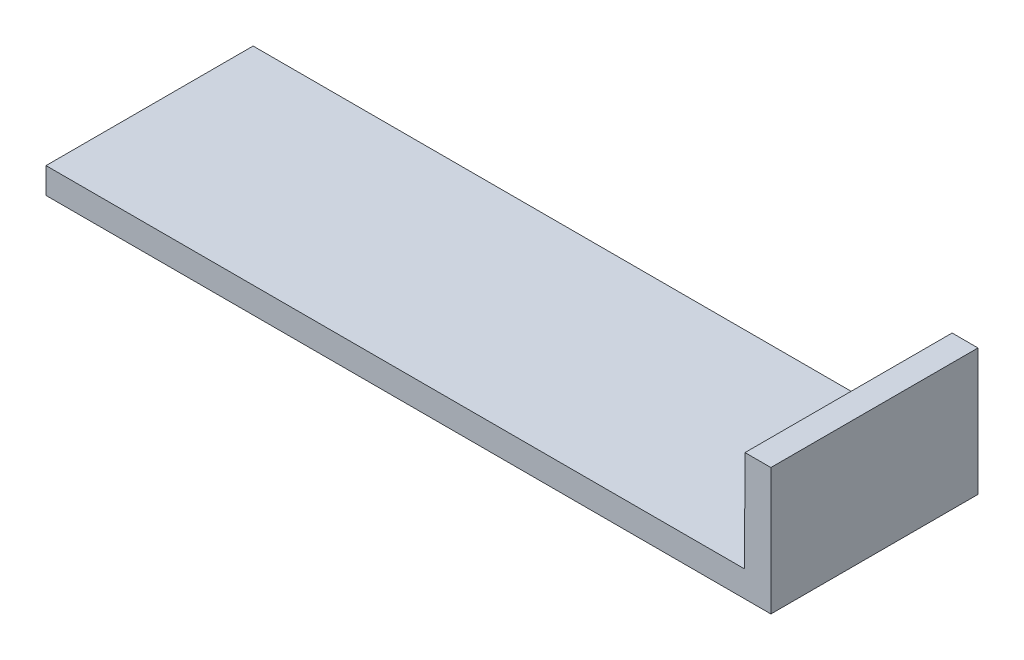
ISO-10303-21;
HEADER;
FILE_DESCRIPTION(('STEP AP214'),'2;1');
FILE_NAME('part.step','',(''),(''),'','','');
FILE_SCHEMA(('AUTOMOTIVE_DESIGN { 1 0 10303 214 1 1 1 1 }'));
ENDSEC;
DATA;
#1=APPLICATION_CONTEXT('core data for automotive mechanical design processes');
#2=APPLICATION_PROTOCOL_DEFINITION('international standard','automotive_design',2000,#1);
#3=PRODUCT_CONTEXT('',#1,'mechanical');
#4=PRODUCT('Part','Part','',(#3));
#5=PRODUCT_RELATED_PRODUCT_CATEGORY('part','',(#4));
#6=PRODUCT_DEFINITION_FORMATION('','',#4);
#7=PRODUCT_DEFINITION_CONTEXT('part definition',#1,'design');
#8=PRODUCT_DEFINITION('design','',#6,#7);
#9=PRODUCT_DEFINITION_SHAPE('','',#8);
#10=(LENGTH_UNIT() NAMED_UNIT(*) SI_UNIT(.MILLI.,.METRE.));
#11=(NAMED_UNIT(*) PLANE_ANGLE_UNIT() SI_UNIT($,.RADIAN.));
#12=(NAMED_UNIT(*) SI_UNIT($,.STERADIAN.) SOLID_ANGLE_UNIT());
#13=UNCERTAINTY_MEASURE_WITH_UNIT(LENGTH_MEASURE(1.E-05),#10,'distance_accuracy_value','');
#14=(GEOMETRIC_REPRESENTATION_CONTEXT(3) GLOBAL_UNCERTAINTY_ASSIGNED_CONTEXT((#13)) GLOBAL_UNIT_ASSIGNED_CONTEXT((#10,
#11,#12)) REPRESENTATION_CONTEXT('',''));
#15=CARTESIAN_POINT('',(0.,0.,0.));
#16=DIRECTION('',(0.,0.,1.));
#17=DIRECTION('',(1.,0.,0.));
#18=AXIS2_PLACEMENT_3D('',#15,#16,#17);
#19=CARTESIAN_POINT('',(0.,15.5575,25.4));
#20=DIRECTION('',(-1.,0.,0.));
#21=DIRECTION('',(0.,-1.,0.));
#22=AXIS2_PLACEMENT_3D('',#19,#20,#21);
#23=PLANE('',#22);
#24=DIRECTION('',(0.,1.,0.));
#25=VECTOR('',#24,1.);
#26=CARTESIAN_POINT('',(0.,15.5575,0.));
#27=LINE('',#26,#25);
#28=CARTESIAN_POINT('',(0.,0.,0.));
#29=VERTEX_POINT('',#28);
#30=CARTESIAN_POINT('',(0.,15.5575,0.));
#31=VERTEX_POINT('',#30);
#32=EDGE_CURVE('E117',#29,#31,#27,.T.);
#33=ORIENTED_EDGE('',*,*,#32,.T.);
#34=DIRECTION('',(0.,0.,-1.));
#35=VECTOR('',#34,1.);
#36=CARTESIAN_POINT('',(0.,15.5575,25.4));
#37=LINE('',#36,#35);
#38=CARTESIAN_POINT('',(0.,15.5575,25.4));
#39=VERTEX_POINT('',#38);
#40=EDGE_CURVE('E11',#39,#31,#37,.T.);
#41=ORIENTED_EDGE('',*,*,#40,.F.);
#42=DIRECTION('',(0.,1.,0.));
#43=VECTOR('',#42,1.);
#44=CARTESIAN_POINT('',(0.,15.5575,25.4));
#45=LINE('',#44,#43);
#46=CARTESIAN_POINT('',(0.,0.,25.4));
#47=VERTEX_POINT('',#46);
#48=EDGE_CURVE('E127',#47,#39,#45,.T.);
#49=ORIENTED_EDGE('',*,*,#48,.F.);
#50=DIRECTION('',(0.,0.,-1.));
#51=VECTOR('',#50,1.);
#52=CARTESIAN_POINT('',(0.,0.,25.4));
#53=LINE('',#52,#51);
#54=EDGE_CURVE('E113',#47,#29,#53,.T.);
#55=ORIENTED_EDGE('',*,*,#54,.T.);
#56=EDGE_LOOP('',(#33,#41,#49,#55));
#57=FACE_BOUND('',#56,.T.);
#58=ADVANCED_FACE('F33',(#57),#23,.F.);
#59=CARTESIAN_POINT('',(-3.175,15.5575,25.4));
#60=DIRECTION('',(0.,-1.,0.));
#61=DIRECTION('',(1.,0.,0.));
#62=AXIS2_PLACEMENT_3D('',#59,#60,#61);
#63=PLANE('',#62);
#64=DIRECTION('',(-1.,0.,0.));
#65=VECTOR('',#64,1.);
#66=CARTESIAN_POINT('',(-3.175,15.5575,0.));
#67=LINE('',#66,#65);
#68=CARTESIAN_POINT('',(-3.175,15.5575,0.));
#69=VERTEX_POINT('',#68);
#70=EDGE_CURVE('E120',#31,#69,#67,.T.);
#71=ORIENTED_EDGE('',*,*,#70,.T.);
#72=DIRECTION('',(0.,0.,-1.));
#73=VECTOR('',#72,1.);
#74=CARTESIAN_POINT('',(-3.175,15.5575,25.4));
#75=LINE('',#74,#73);
#76=CARTESIAN_POINT('',(-3.175,15.5575,25.4));
#77=VERTEX_POINT('',#76);
#78=EDGE_CURVE('E41',#77,#69,#75,.T.);
#79=ORIENTED_EDGE('',*,*,#78,.F.);
#80=DIRECTION('',(-1.,0.,0.));
#81=VECTOR('',#80,1.);
#82=CARTESIAN_POINT('',(-3.175,15.5575,25.4));
#83=LINE('',#82,#81);
#84=EDGE_CURVE('E86',#39,#77,#83,.T.);
#85=ORIENTED_EDGE('',*,*,#84,.F.);
#86=ORIENTED_EDGE('',*,*,#40,.T.);
#87=EDGE_LOOP('',(#71,#79,#85,#86));
#88=FACE_BOUND('',#87,.T.);
#89=ADVANCED_FACE('F151',(#88),#63,.F.);
#90=CARTESIAN_POINT('',(-3.23849999999999,3.17499999999999,25.4));
#91=DIRECTION('',(0.99998685101543,-0.00512813769751423,0.));
#92=DIRECTION('',(0.00512813769751423,0.99998685101543,0.));
#93=AXIS2_PLACEMENT_3D('',#90,#91,#92);
#94=PLANE('',#93);
#95=DIRECTION('',(-0.00512813769751423,-0.99998685101543,0.));
#96=VECTOR('',#95,1.);
#97=CARTESIAN_POINT('',(-3.23849999999999,3.17499999999999,0.));
#98=LINE('',#97,#96);
#99=CARTESIAN_POINT('',(-3.23849999999999,3.17499999999999,0.));
#100=VERTEX_POINT('',#99);
#101=EDGE_CURVE('E122',#69,#100,#98,.T.);
#102=ORIENTED_EDGE('',*,*,#101,.T.);
#103=DIRECTION('',(0.,0.,-1.));
#104=VECTOR('',#103,1.);
#105=CARTESIAN_POINT('',(-3.23849999999999,3.17499999999999,25.4));
#106=LINE('',#105,#104);
#107=CARTESIAN_POINT('',(-3.23849999999999,3.17499999999999,25.4));
#108=VERTEX_POINT('',#107);
#109=EDGE_CURVE('E108',#108,#100,#106,.T.);
#110=ORIENTED_EDGE('',*,*,#109,.F.);
#111=DIRECTION('',(-0.00512813769751423,-0.99998685101543,0.));
#112=VECTOR('',#111,1.);
#113=CARTESIAN_POINT('',(-3.23849999999999,3.17499999999999,25.4));
#114=LINE('',#113,#112);
#115=EDGE_CURVE('E99',#77,#108,#114,.T.);
#116=ORIENTED_EDGE('',*,*,#115,.F.);
#117=ORIENTED_EDGE('',*,*,#78,.T.);
#118=EDGE_LOOP('',(#102,#110,#116,#117));
#119=FACE_BOUND('',#118,.T.);
#120=ADVANCED_FACE('F133',(#119),#94,.F.);
#121=CARTESIAN_POINT('',(-88.9,3.17499999999999,25.4));
#122=DIRECTION('',(0.,-1.,0.));
#123=DIRECTION('',(0.,0.,-1.));
#124=AXIS2_PLACEMENT_3D('',#121,#122,#123);
#125=PLANE('',#124);
#126=DIRECTION('',(-1.,0.,0.));
#127=VECTOR('',#126,1.);
#128=CARTESIAN_POINT('',(-88.9,3.17499999999999,0.));
#129=LINE('',#128,#127);
#130=CARTESIAN_POINT('',(-88.9,3.17499999999999,0.));
#131=VERTEX_POINT('',#130);
#132=EDGE_CURVE('E107',#100,#131,#129,.T.);
#133=ORIENTED_EDGE('',*,*,#132,.T.);
#134=DIRECTION('',(0.,0.,-1.));
#135=VECTOR('',#134,1.);
#136=CARTESIAN_POINT('',(-88.9,3.17499999999999,25.4));
#137=LINE('',#136,#135);
#138=CARTESIAN_POINT('',(-88.9,3.17499999999999,25.4));
#139=VERTEX_POINT('',#138);
#140=EDGE_CURVE('E104',#139,#131,#137,.T.);
#141=ORIENTED_EDGE('',*,*,#140,.F.);
#142=DIRECTION('',(-1.,0.,0.));
#143=VECTOR('',#142,1.);
#144=CARTESIAN_POINT('',(-88.9,3.17499999999999,25.4));
#145=LINE('',#144,#143);
#146=EDGE_CURVE('E93',#108,#139,#145,.T.);
#147=ORIENTED_EDGE('',*,*,#146,.F.);
#148=ORIENTED_EDGE('',*,*,#109,.T.);
#149=EDGE_LOOP('',(#133,#141,#147,#148));
#150=FACE_BOUND('',#149,.T.);
#151=ADVANCED_FACE('F105',(#150),#125,.F.);
#152=CARTESIAN_POINT('',(-88.9,0.,25.4));
#153=DIRECTION('',(1.,0.,0.));
#154=DIRECTION('',(0.,0.,-1.));
#155=AXIS2_PLACEMENT_3D('',#152,#153,#154);
#156=PLANE('',#155);
#157=DIRECTION('',(0.,-1.,0.));
#158=VECTOR('',#157,1.);
#159=CARTESIAN_POINT('',(-88.9,0.,0.));
#160=LINE('',#159,#158);
#161=CARTESIAN_POINT('',(-88.9,0.,0.));
#162=VERTEX_POINT('',#161);
#163=EDGE_CURVE('E72',#131,#162,#160,.T.);
#164=ORIENTED_EDGE('',*,*,#163,.T.);
#165=DIRECTION('',(0.,0.,-1.));
#166=VECTOR('',#165,1.);
#167=CARTESIAN_POINT('',(-88.9,0.,25.4));
#168=LINE('',#167,#166);
#169=CARTESIAN_POINT('',(-88.9,0.,25.4));
#170=VERTEX_POINT('',#169);
#171=EDGE_CURVE('E109',#170,#162,#168,.T.);
#172=ORIENTED_EDGE('',*,*,#171,.F.);
#173=DIRECTION('',(0.,-1.,0.));
#174=VECTOR('',#173,1.);
#175=CARTESIAN_POINT('',(-88.9,0.,25.4));
#176=LINE('',#175,#174);
#177=EDGE_CURVE('E97',#139,#170,#176,.T.);
#178=ORIENTED_EDGE('',*,*,#177,.F.);
#179=ORIENTED_EDGE('',*,*,#140,.T.);
#180=EDGE_LOOP('',(#164,#172,#178,#179));
#181=FACE_BOUND('',#180,.T.);
#182=ADVANCED_FACE('F111',(#181),#156,.F.);
#183=CARTESIAN_POINT('',(0.,0.,25.4));
#184=DIRECTION('',(0.,1.,0.));
#185=DIRECTION('',(-1.,0.,0.));
#186=AXIS2_PLACEMENT_3D('',#183,#184,#185);
#187=PLANE('',#186);
#188=DIRECTION('',(1.,0.,0.));
#189=VECTOR('',#188,1.);
#190=CARTESIAN_POINT('',(0.,0.,0.));
#191=LINE('',#190,#189);
#192=EDGE_CURVE('E78',#162,#29,#191,.T.);
#193=ORIENTED_EDGE('',*,*,#192,.T.);
#194=ORIENTED_EDGE('',*,*,#54,.F.);
#195=DIRECTION('',(1.,0.,0.));
#196=VECTOR('',#195,1.);
#197=CARTESIAN_POINT('',(0.,0.,25.4));
#198=LINE('',#197,#196);
#199=EDGE_CURVE('E49',#170,#47,#198,.T.);
#200=ORIENTED_EDGE('',*,*,#199,.F.);
#201=ORIENTED_EDGE('',*,*,#171,.T.);
#202=EDGE_LOOP('',(#193,#194,#200,#201));
#203=FACE_BOUND('',#202,.T.);
#204=ADVANCED_FACE('F140',(#203),#187,.F.);
#205=CARTESIAN_POINT('',(0.,0.,25.4));
#206=DIRECTION('',(0.,0.,-1.));
#207=DIRECTION('',(-1.,0.,0.));
#208=AXIS2_PLACEMENT_3D('',#205,#206,#207);
#209=PLANE('',#208);
#210=ORIENTED_EDGE('',*,*,#48,.T.);
#211=ORIENTED_EDGE('',*,*,#84,.T.);
#212=ORIENTED_EDGE('',*,*,#115,.T.);
#213=ORIENTED_EDGE('',*,*,#146,.T.);
#214=ORIENTED_EDGE('',*,*,#177,.T.);
#215=ORIENTED_EDGE('',*,*,#199,.T.);
#216=EDGE_LOOP('',(#210,#211,#212,#213,#214,#215));
#217=FACE_BOUND('',#216,.T.);
#218=ADVANCED_FACE('F95',(#217),#209,.F.);
#219=CARTESIAN_POINT('',(0.,0.,0.));
#220=DIRECTION('',(0.,0.,-1.));
#221=DIRECTION('',(-1.,0.,0.));
#222=AXIS2_PLACEMENT_3D('',#219,#220,#221);
#223=PLANE('',#222);
#224=ORIENTED_EDGE('',*,*,#32,.F.);
#225=ORIENTED_EDGE('',*,*,#192,.F.);
#226=ORIENTED_EDGE('',*,*,#163,.F.);
#227=ORIENTED_EDGE('',*,*,#132,.F.);
#228=ORIENTED_EDGE('',*,*,#101,.F.);
#229=ORIENTED_EDGE('',*,*,#70,.F.);
#230=EDGE_LOOP('',(#224,#225,#226,#227,#228,#229));
#231=FACE_BOUND('',#230,.T.);
#232=ADVANCED_FACE('F136',(#231),#223,.T.);
#233=CLOSED_SHELL('',(#58,#89,#120,#151,#182,#204,#218,#232));
#234=MANIFOLD_SOLID_BREP('B2',#233);
#235=ADVANCED_BREP_SHAPE_REPRESENTATION('',(#18,#234),#14);
#236=SHAPE_DEFINITION_REPRESENTATION(#9,#235);
ENDSEC;
END-ISO-10303-21;
